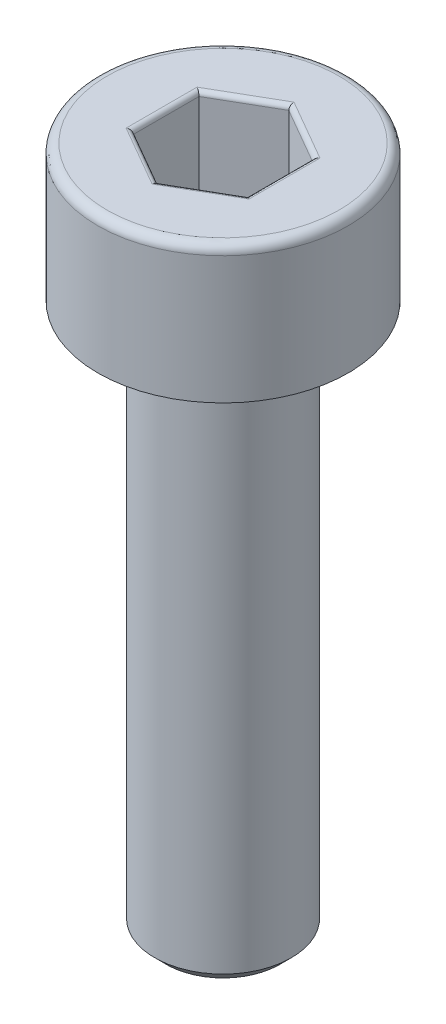
ISO-10303-21;
HEADER;
FILE_DESCRIPTION(('STEP AP214'),'2;1');
FILE_NAME('part.step','',(''),(''),'','','');
FILE_SCHEMA(('AUTOMOTIVE_DESIGN { 1 0 10303 214 1 1 1 1 }'));
ENDSEC;
DATA;
#1=APPLICATION_CONTEXT('core data for automotive mechanical design processes');
#2=APPLICATION_PROTOCOL_DEFINITION('international standard','automotive_design',2000,#1);
#3=PRODUCT_CONTEXT('',#1,'mechanical');
#4=PRODUCT('Part','Part','',(#3));
#5=PRODUCT_RELATED_PRODUCT_CATEGORY('part','',(#4));
#6=PRODUCT_DEFINITION_FORMATION('','',#4);
#7=PRODUCT_DEFINITION_CONTEXT('part definition',#1,'design');
#8=PRODUCT_DEFINITION('design','',#6,#7);
#9=PRODUCT_DEFINITION_SHAPE('','',#8);
#10=(LENGTH_UNIT() NAMED_UNIT(*) SI_UNIT(.MILLI.,.METRE.));
#11=(NAMED_UNIT(*) PLANE_ANGLE_UNIT() SI_UNIT($,.RADIAN.));
#12=(NAMED_UNIT(*) SI_UNIT($,.STERADIAN.) SOLID_ANGLE_UNIT());
#13=UNCERTAINTY_MEASURE_WITH_UNIT(LENGTH_MEASURE(1.E-05),#10,'distance_accuracy_value','');
#14=(GEOMETRIC_REPRESENTATION_CONTEXT(3) GLOBAL_UNCERTAINTY_ASSIGNED_CONTEXT((#13)) GLOBAL_UNIT_ASSIGNED_CONTEXT((#10,
#11,#12)) REPRESENTATION_CONTEXT('',''));
#15=CARTESIAN_POINT('',(0.,0.,0.));
#16=DIRECTION('',(0.,0.,1.));
#17=DIRECTION('',(1.,0.,0.));
#18=AXIS2_PLACEMENT_3D('',#15,#16,#17);
#19=CARTESIAN_POINT('',(0.,-15.,0.));
#20=DIRECTION('',(0.,-1.,0.));
#21=DIRECTION('',(0.,0.,-1.));
#22=AXIS2_PLACEMENT_3D('',#19,#20,#21);
#23=PLANE('',#22);
#24=CARTESIAN_POINT('',(0.,-15.,0.));
#25=DIRECTION('',(0.,-1.,0.));
#26=DIRECTION('',(0.,0.,-1.));
#27=AXIS2_PLACEMENT_3D('',#24,#25,#26);
#28=CIRCLE('',#27,1.25);
#29=CARTESIAN_POINT('',(0.,-15.,-1.25));
#30=VERTEX_POINT('',#29);
#31=EDGE_CURVE('E263',#30,#30,#28,.T.);
#32=ORIENTED_EDGE('',*,*,#31,.T.);
#33=EDGE_LOOP('',(#32));
#34=FACE_BOUND('',#33,.T.);
#35=ADVANCED_FACE('F35',(#34),#23,.T.);
#36=CARTESIAN_POINT('',(0.,0.,0.));
#37=DIRECTION('',(0.,1.,0.));
#38=DIRECTION('',(0.,0.,1.));
#39=AXIS2_PLACEMENT_3D('',#36,#37,#38);
#40=CYLINDRICAL_SURFACE('',#39,1.5);
#41=CARTESIAN_POINT('',(0.,-3.25,0.));
#42=DIRECTION('',(0.,-1.,0.));
#43=DIRECTION('',(0.,0.,-1.));
#44=AXIS2_PLACEMENT_3D('',#41,#42,#43);
#45=CIRCLE('',#44,1.5);
#46=CARTESIAN_POINT('',(0.,-3.25,-1.5));
#47=VERTEX_POINT('',#46);
#48=EDGE_CURVE('E260',#47,#47,#45,.T.);
#49=ORIENTED_EDGE('',*,*,#48,.T.);
#50=EDGE_LOOP('',(#49));
#51=FACE_BOUND('',#50,.T.);
#52=CARTESIAN_POINT('',(0.,-14.75,0.));
#53=DIRECTION('',(0.,-1.,0.));
#54=DIRECTION('',(0.,0.,-1.));
#55=AXIS2_PLACEMENT_3D('',#52,#53,#54);
#56=CIRCLE('',#55,1.5);
#57=CARTESIAN_POINT('',(0.,-14.75,-1.5));
#58=VERTEX_POINT('',#57);
#59=EDGE_CURVE('E257',#58,#58,#56,.F.);
#60=ORIENTED_EDGE('',*,*,#59,.T.);
#61=EDGE_LOOP('',(#60));
#62=FACE_BOUND('',#61,.T.);
#63=ADVANCED_FACE('F289',(#51,#62),#40,.T.);
#64=CARTESIAN_POINT('',(-1.5,-3.,0.));
#65=DIRECTION('',(0.,-1.,0.));
#66=DIRECTION('',(0.,0.,-1.));
#67=AXIS2_PLACEMENT_3D('',#64,#65,#66);
#68=PLANE('',#67);
#69=CARTESIAN_POINT('',(0.,-3.,0.));
#70=DIRECTION('',(0.,-1.,0.));
#71=DIRECTION('',(0.,0.,-1.));
#72=AXIS2_PLACEMENT_3D('',#69,#70,#71);
#73=CIRCLE('',#72,1.75);
#74=CARTESIAN_POINT('',(0.,-3.,-1.75));
#75=VERTEX_POINT('',#74);
#76=EDGE_CURVE('E254',#75,#75,#73,.F.);
#77=ORIENTED_EDGE('',*,*,#76,.T.);
#78=EDGE_LOOP('',(#77));
#79=FACE_BOUND('',#78,.T.);
#80=CARTESIAN_POINT('',(0.,-3.,0.));
#81=DIRECTION('',(0.,1.,0.));
#82=DIRECTION('',(0.,0.,1.));
#83=AXIS2_PLACEMENT_3D('',#80,#81,#82);
#84=CIRCLE('',#83,2.75);
#85=CARTESIAN_POINT('',(0.,-3.,2.75));
#86=VERTEX_POINT('',#85);
#87=EDGE_CURVE('E251',#86,#86,#84,.T.);
#88=ORIENTED_EDGE('',*,*,#87,.F.);
#89=EDGE_LOOP('',(#88));
#90=FACE_BOUND('',#89,.T.);
#91=ADVANCED_FACE('F295',(#79,#90),#68,.T.);
#92=CARTESIAN_POINT('',(0.,0.,0.));
#93=DIRECTION('',(0.,1.,0.));
#94=DIRECTION('',(0.,0.,1.));
#95=AXIS2_PLACEMENT_3D('',#92,#93,#94);
#96=CYLINDRICAL_SURFACE('',#95,2.75);
#97=CARTESIAN_POINT('',(0.,-0.2,0.));
#98=DIRECTION('',(0.,1.,0.));
#99=DIRECTION('',(0.,0.,1.));
#100=AXIS2_PLACEMENT_3D('',#97,#98,#99);
#101=CIRCLE('',#100,2.75);
#102=CARTESIAN_POINT('',(0.,-0.2,2.75));
#103=VERTEX_POINT('',#102);
#104=EDGE_CURVE('E161',#103,#103,#101,.F.);
#105=ORIENTED_EDGE('',*,*,#104,.T.);
#106=EDGE_LOOP('',(#105));
#107=FACE_BOUND('',#106,.T.);
#108=ORIENTED_EDGE('',*,*,#87,.T.);
#109=EDGE_LOOP('',(#108));
#110=FACE_BOUND('',#109,.T.);
#111=ADVANCED_FACE('F305',(#107,#110),#96,.T.);
#112=CARTESIAN_POINT('',(-2.75,0.,0.));
#113=DIRECTION('',(0.,1.,0.));
#114=DIRECTION('',(0.,0.,1.));
#115=AXIS2_PLACEMENT_3D('',#112,#113,#114);
#116=PLANE('',#115);
#117=DIRECTION('',(0.,0.,1.));
#118=VECTOR('',#117,1.);
#119=CARTESIAN_POINT('',(-1.35,0.,-0.721687836487033));
#120=LINE('',#119,#118);
#121=CARTESIAN_POINT('',(-1.35,0.,0.779422863405995));
#122=VERTEX_POINT('',#121);
#123=CARTESIAN_POINT('',(-1.35,0.,-0.779422863405995));
#124=VERTEX_POINT('',#123);
#125=EDGE_CURVE('E177',#122,#124,#120,.F.);
#126=ORIENTED_EDGE('',*,*,#125,.T.);
#127=DIRECTION('',(-0.866025403784439,0.,0.5));
#128=VECTOR('',#127,1.);
#129=CARTESIAN_POINT('',(-0.0500000000000002,0.,-1.52997821335251));
#130=LINE('',#129,#128);
#131=CARTESIAN_POINT('',(0.,0.,-1.55884572681199));
#132=VERTEX_POINT('',#131);
#133=EDGE_CURVE('E136',#124,#132,#130,.F.);
#134=ORIENTED_EDGE('',*,*,#133,.T.);
#135=DIRECTION('',(-0.866025403784439,0.,-0.5));
#136=VECTOR('',#135,1.);
#137=CARTESIAN_POINT('',(1.3,0.,-0.808290376865477));
#138=LINE('',#137,#136);
#139=CARTESIAN_POINT('',(1.35,0.,-0.779422863405995));
#140=VERTEX_POINT('',#139);
#141=EDGE_CURVE('E163',#132,#140,#138,.F.);
#142=ORIENTED_EDGE('',*,*,#141,.T.);
#143=DIRECTION('',(0.,0.,-1.));
#144=VECTOR('',#143,1.);
#145=CARTESIAN_POINT('',(1.35,0.,0.721687836487034));
#146=LINE('',#145,#144);
#147=CARTESIAN_POINT('',(1.35,0.,0.779422863405996));
#148=VERTEX_POINT('',#147);
#149=EDGE_CURVE('E171',#140,#148,#146,.F.);
#150=ORIENTED_EDGE('',*,*,#149,.T.);
#151=DIRECTION('',(0.866025403784439,0.,-0.5));
#152=VECTOR('',#151,1.);
#153=CARTESIAN_POINT('',(0.05,0.,1.52997821335251));
#154=LINE('',#153,#152);
#155=CARTESIAN_POINT('',(0.,0.,1.55884572681199));
#156=VERTEX_POINT('',#155);
#157=EDGE_CURVE('E173',#148,#156,#154,.F.);
#158=ORIENTED_EDGE('',*,*,#157,.T.);
#159=DIRECTION('',(0.866025403784438,0.,0.5));
#160=VECTOR('',#159,1.);
#161=CARTESIAN_POINT('',(-1.3,0.,0.808290376865476));
#162=LINE('',#161,#160);
#163=EDGE_CURVE('E175',#156,#122,#162,.F.);
#164=ORIENTED_EDGE('',*,*,#163,.T.);
#165=EDGE_LOOP('',(#126,#134,#142,#150,#158,#164));
#166=FACE_BOUND('',#165,.T.);
#167=CARTESIAN_POINT('',(0.,0.,0.));
#168=DIRECTION('',(0.,1.,0.));
#169=DIRECTION('',(0.,0.,1.));
#170=AXIS2_PLACEMENT_3D('',#167,#168,#169);
#171=CIRCLE('',#170,2.55);
#172=CARTESIAN_POINT('',(0.,0.,2.55));
#173=VERTEX_POINT('',#172);
#174=EDGE_CURVE('E166',#173,#173,#171,.T.);
#175=ORIENTED_EDGE('',*,*,#174,.T.);
#176=EDGE_LOOP('',(#175));
#177=FACE_BOUND('',#176,.T.);
#178=ADVANCED_FACE('F268',(#166,#177),#116,.T.);
#179=CARTESIAN_POINT('',(0.,-3.,0.));
#180=DIRECTION('',(0.,1.,0.));
#181=DIRECTION('',(0.,0.,1.));
#182=AXIS2_PLACEMENT_3D('',#179,#180,#181);
#183=CONICAL_SURFACE('',#182,1.75,0.785398163397455);
#184=ORIENTED_EDGE('',*,*,#48,.F.);
#185=EDGE_LOOP('',(#184));
#186=FACE_BOUND('',#185,.T.);
#187=ORIENTED_EDGE('',*,*,#76,.F.);
#188=EDGE_LOOP('',(#187));
#189=FACE_BOUND('',#188,.T.);
#190=ADVANCED_FACE('F283',(#186,#189),#183,.T.);
#191=CARTESIAN_POINT('',(0.,-14.75,0.));
#192=DIRECTION('',(0.,1.,0.));
#193=DIRECTION('',(0.,0.,1.));
#194=AXIS2_PLACEMENT_3D('',#191,#192,#193);
#195=CONICAL_SURFACE('',#194,1.5,0.785398163397447);
#196=ORIENTED_EDGE('',*,*,#31,.F.);
#197=EDGE_LOOP('',(#196));
#198=FACE_BOUND('',#197,.T.);
#199=ORIENTED_EDGE('',*,*,#59,.F.);
#200=EDGE_LOOP('',(#199));
#201=FACE_BOUND('',#200,.T.);
#202=ADVANCED_FACE('F273',(#198,#201),#195,.T.);
#203=CARTESIAN_POINT('',(0.,-0.2,0.));
#204=DIRECTION('',(0.,1.,0.));
#205=DIRECTION('',(0.,0.,1.));
#206=AXIS2_PLACEMENT_3D('',#203,#204,#205);
#207=TOROIDAL_SURFACE('',#206,2.55,0.2);
#208=ORIENTED_EDGE('',*,*,#104,.F.);
#209=EDGE_LOOP('',(#208));
#210=FACE_BOUND('',#209,.T.);
#211=ORIENTED_EDGE('',*,*,#174,.F.);
#212=EDGE_LOOP('',(#211));
#213=FACE_BOUND('',#212,.T.);
#214=ADVANCED_FACE('F270',(#210,#213),#207,.T.);
#215=CARTESIAN_POINT('',(1.25,-2.,-0.721687836487033));
#216=DIRECTION('',(0.5,0.,-0.866025403784439));
#217=DIRECTION('',(-0.866025403784439,0.,-0.5));
#218=AXIS2_PLACEMENT_3D('',#215,#216,#217);
#219=PLANE('',#218);
#220=DIRECTION('',(0.,1.,0.));
#221=VECTOR('',#220,1.);
#222=CARTESIAN_POINT('',(1.25,-2.,-0.721687836487033));
#223=LINE('',#222,#221);
#224=CARTESIAN_POINT('',(1.25,-1.9,-0.721687836487033));
#225=VERTEX_POINT('',#224);
#226=CARTESIAN_POINT('',(1.25,-0.1,-0.721687836487033));
#227=VERTEX_POINT('',#226);
#228=EDGE_CURVE('E245',#225,#227,#223,.T.);
#229=ORIENTED_EDGE('',*,*,#228,.T.);
#230=DIRECTION('',(-0.866025403784439,0.,-0.5));
#231=VECTOR('',#230,1.);
#232=CARTESIAN_POINT('',(0.,-0.1,-1.44337567297406));
#233=LINE('',#232,#231);
#234=CARTESIAN_POINT('',(0.,-0.1,-1.44337567297406));
#235=VERTEX_POINT('',#234);
#236=EDGE_CURVE('E197',#227,#235,#233,.T.);
#237=ORIENTED_EDGE('',*,*,#236,.T.);
#238=DIRECTION('',(0.,1.,0.));
#239=VECTOR('',#238,1.);
#240=CARTESIAN_POINT('',(0.,-2.,-1.44337567297406));
#241=LINE('',#240,#239);
#242=CARTESIAN_POINT('',(0.,-1.9,-1.44337567297406));
#243=VERTEX_POINT('',#242);
#244=EDGE_CURVE('E147',#243,#235,#241,.T.);
#245=ORIENTED_EDGE('',*,*,#244,.F.);
#246=DIRECTION('',(-0.866025403784439,0.,-0.5));
#247=VECTOR('',#246,1.);
#248=CARTESIAN_POINT('',(1.25,-1.9,-0.721687836487033));
#249=LINE('',#248,#247);
#250=EDGE_CURVE('E195',#243,#225,#249,.F.);
#251=ORIENTED_EDGE('',*,*,#250,.T.);
#252=EDGE_LOOP('',(#229,#237,#245,#251));
#253=FACE_BOUND('',#252,.T.);
#254=ADVANCED_FACE('F272',(#253),#219,.F.);
#255=CARTESIAN_POINT('',(1.25,-2.,0.721687836487034));
#256=DIRECTION('',(1.,0.,0.));
#257=DIRECTION('',(0.,0.,-1.));
#258=AXIS2_PLACEMENT_3D('',#255,#256,#257);
#259=PLANE('',#258);
#260=DIRECTION('',(0.,1.,0.));
#261=VECTOR('',#260,1.);
#262=CARTESIAN_POINT('',(1.25,-2.,0.721687836487034));
#263=LINE('',#262,#261);
#264=CARTESIAN_POINT('',(1.25,-1.9,0.721687836487034));
#265=VERTEX_POINT('',#264);
#266=CARTESIAN_POINT('',(1.25,-0.1,0.721687836487034));
#267=VERTEX_POINT('',#266);
#268=EDGE_CURVE('E242',#265,#267,#263,.T.);
#269=ORIENTED_EDGE('',*,*,#268,.T.);
#270=DIRECTION('',(0.,0.,-1.));
#271=VECTOR('',#270,1.);
#272=CARTESIAN_POINT('',(1.25,-0.1,-0.721687836487033));
#273=LINE('',#272,#271);
#274=EDGE_CURVE('E193',#267,#227,#273,.T.);
#275=ORIENTED_EDGE('',*,*,#274,.T.);
#276=ORIENTED_EDGE('',*,*,#228,.F.);
#277=DIRECTION('',(0.,0.,-1.));
#278=VECTOR('',#277,1.);
#279=CARTESIAN_POINT('',(1.25,-1.9,0.721687836487034));
#280=LINE('',#279,#278);
#281=EDGE_CURVE('E190',#225,#265,#280,.F.);
#282=ORIENTED_EDGE('',*,*,#281,.T.);
#283=EDGE_LOOP('',(#269,#275,#276,#282));
#284=FACE_BOUND('',#283,.T.);
#285=ADVANCED_FACE('F280',(#284),#259,.F.);
#286=CARTESIAN_POINT('',(0.,-2.,1.44337567297407));
#287=DIRECTION('',(0.5,0.,0.866025403784439));
#288=DIRECTION('',(0.866025403784439,0.,-0.5));
#289=AXIS2_PLACEMENT_3D('',#286,#287,#288);
#290=PLANE('',#289);
#291=DIRECTION('',(0.,1.,0.));
#292=VECTOR('',#291,1.);
#293=CARTESIAN_POINT('',(0.,-2.,1.44337567297407));
#294=LINE('',#293,#292);
#295=CARTESIAN_POINT('',(0.,-1.9,1.44337567297407));
#296=VERTEX_POINT('',#295);
#297=CARTESIAN_POINT('',(0.,-0.1,1.44337567297407));
#298=VERTEX_POINT('',#297);
#299=EDGE_CURVE('E239',#296,#298,#294,.T.);
#300=ORIENTED_EDGE('',*,*,#299,.T.);
#301=DIRECTION('',(0.866025403784439,0.,-0.5));
#302=VECTOR('',#301,1.);
#303=CARTESIAN_POINT('',(1.25,-0.1,0.721687836487034));
#304=LINE('',#303,#302);
#305=EDGE_CURVE('E188',#298,#267,#304,.T.);
#306=ORIENTED_EDGE('',*,*,#305,.T.);
#307=ORIENTED_EDGE('',*,*,#268,.F.);
#308=DIRECTION('',(0.866025403784439,0.,-0.5));
#309=VECTOR('',#308,1.);
#310=CARTESIAN_POINT('',(0.,-1.9,1.44337567297407));
#311=LINE('',#310,#309);
#312=EDGE_CURVE('E186',#265,#296,#311,.F.);
#313=ORIENTED_EDGE('',*,*,#312,.T.);
#314=EDGE_LOOP('',(#300,#306,#307,#313));
#315=FACE_BOUND('',#314,.T.);
#316=ADVANCED_FACE('F329',(#315),#290,.F.);
#317=CARTESIAN_POINT('',(-1.25,-2.,0.721687836487033));
#318=DIRECTION('',(-0.5,0.,0.866025403784439));
#319=DIRECTION('',(0.866025403784438,0.,0.5));
#320=AXIS2_PLACEMENT_3D('',#317,#318,#319);
#321=PLANE('',#320);
#322=DIRECTION('',(0.,1.,0.));
#323=VECTOR('',#322,1.);
#324=CARTESIAN_POINT('',(-1.25,-2.,0.721687836487033));
#325=LINE('',#324,#323);
#326=CARTESIAN_POINT('',(-1.25,-1.9,0.721687836487033));
#327=VERTEX_POINT('',#326);
#328=CARTESIAN_POINT('',(-1.25,-0.1,0.721687836487033));
#329=VERTEX_POINT('',#328);
#330=EDGE_CURVE('E130',#327,#329,#325,.T.);
#331=ORIENTED_EDGE('',*,*,#330,.T.);
#332=DIRECTION('',(0.866025403784438,0.,0.5));
#333=VECTOR('',#332,1.);
#334=CARTESIAN_POINT('',(0.,-0.1,1.44337567297407));
#335=LINE('',#334,#333);
#336=EDGE_CURVE('E184',#329,#298,#335,.T.);
#337=ORIENTED_EDGE('',*,*,#336,.T.);
#338=ORIENTED_EDGE('',*,*,#299,.F.);
#339=DIRECTION('',(0.866025403784438,0.,0.5));
#340=VECTOR('',#339,1.);
#341=CARTESIAN_POINT('',(-1.25,-1.9,0.721687836487033));
#342=LINE('',#341,#340);
#343=EDGE_CURVE('E182',#296,#327,#342,.F.);
#344=ORIENTED_EDGE('',*,*,#343,.T.);
#345=EDGE_LOOP('',(#331,#337,#338,#344));
#346=FACE_BOUND('',#345,.T.);
#347=ADVANCED_FACE('F236',(#346),#321,.F.);
#348=CARTESIAN_POINT('',(-1.25,-2.,-0.721687836487033));
#349=DIRECTION('',(-1.,0.,0.));
#350=DIRECTION('',(0.,0.,1.));
#351=AXIS2_PLACEMENT_3D('',#348,#349,#350);
#352=PLANE('',#351);
#353=DIRECTION('',(0.,1.,0.));
#354=VECTOR('',#353,1.);
#355=CARTESIAN_POINT('',(-1.25,-2.,-0.721687836487033));
#356=LINE('',#355,#354);
#357=CARTESIAN_POINT('',(-1.25,-1.9,-0.721687836487033));
#358=VERTEX_POINT('',#357);
#359=CARTESIAN_POINT('',(-1.25,-0.1,-0.721687836487033));
#360=VERTEX_POINT('',#359);
#361=EDGE_CURVE('E128',#358,#360,#356,.T.);
#362=ORIENTED_EDGE('',*,*,#361,.T.);
#363=DIRECTION('',(0.,0.,1.));
#364=VECTOR('',#363,1.);
#365=CARTESIAN_POINT('',(-1.25,-0.1,0.721687836487033));
#366=LINE('',#365,#364);
#367=EDGE_CURVE('E135',#360,#329,#366,.T.);
#368=ORIENTED_EDGE('',*,*,#367,.T.);
#369=ORIENTED_EDGE('',*,*,#330,.F.);
#370=DIRECTION('',(0.,0.,1.));
#371=VECTOR('',#370,1.);
#372=CARTESIAN_POINT('',(-1.25,-1.9,-0.721687836487033));
#373=LINE('',#372,#371);
#374=EDGE_CURVE('E125',#327,#358,#373,.F.);
#375=ORIENTED_EDGE('',*,*,#374,.T.);
#376=EDGE_LOOP('',(#362,#368,#369,#375));
#377=FACE_BOUND('',#376,.T.);
#378=ADVANCED_FACE('F127',(#377),#352,.F.);
#379=CARTESIAN_POINT('',(0.,-2.,-1.44337567297406));
#380=DIRECTION('',(-0.5,0.,-0.866025403784439));
#381=DIRECTION('',(-0.866025403784439,0.,0.5));
#382=AXIS2_PLACEMENT_3D('',#379,#380,#381);
#383=PLANE('',#382);
#384=ORIENTED_EDGE('',*,*,#244,.T.);
#385=DIRECTION('',(-0.866025403784439,0.,0.5));
#386=VECTOR('',#385,1.);
#387=CARTESIAN_POINT('',(-1.25,-0.1,-0.721687836487032));
#388=LINE('',#387,#386);
#389=EDGE_CURVE('E146',#235,#360,#388,.T.);
#390=ORIENTED_EDGE('',*,*,#389,.T.);
#391=ORIENTED_EDGE('',*,*,#361,.F.);
#392=DIRECTION('',(-0.866025403784439,0.,0.5));
#393=VECTOR('',#392,1.);
#394=CARTESIAN_POINT('',(0.,-1.9,-1.44337567297406));
#395=LINE('',#394,#393);
#396=EDGE_CURVE('E143',#358,#243,#395,.F.);
#397=ORIENTED_EDGE('',*,*,#396,.T.);
#398=EDGE_LOOP('',(#384,#390,#391,#397));
#399=FACE_BOUND('',#398,.T.);
#400=ADVANCED_FACE('F141',(#399),#383,.F.);
#401=CARTESIAN_POINT('',(1.25,-2.,-0.721687836487033));
#402=DIRECTION('',(0.,-1.,0.));
#403=DIRECTION('',(0.,0.,-1.));
#404=AXIS2_PLACEMENT_3D('',#401,#402,#403);
#405=PLANE('',#404);
#406=DIRECTION('',(0.866025403784439,0.,-0.5));
#407=VECTOR('',#406,1.);
#408=CARTESIAN_POINT('',(1.2,-2.,0.63508529610859));
#409=LINE('',#408,#407);
#410=CARTESIAN_POINT('',(0.,-2.,1.32790561913614));
#411=VERTEX_POINT('',#410);
#412=CARTESIAN_POINT('',(1.15,-2.,0.663952809568071));
#413=VERTEX_POINT('',#412);
#414=EDGE_CURVE('E44',#411,#413,#409,.T.);
#415=ORIENTED_EDGE('',*,*,#414,.T.);
#416=DIRECTION('',(0.,0.,-1.));
#417=VECTOR('',#416,1.);
#418=CARTESIAN_POINT('',(1.15,-2.,-0.721687836487033));
#419=LINE('',#418,#417);
#420=CARTESIAN_POINT('',(1.15,-2.,-0.66395280956807));
#421=VERTEX_POINT('',#420);
#422=EDGE_CURVE('E11',#413,#421,#419,.T.);
#423=ORIENTED_EDGE('',*,*,#422,.T.);
#424=DIRECTION('',(-0.866025403784439,0.,-0.5));
#425=VECTOR('',#424,1.);
#426=CARTESIAN_POINT('',(-0.0500000000000001,-2.,-1.35677313259562));
#427=LINE('',#426,#425);
#428=CARTESIAN_POINT('',(0.,-2.,-1.32790561913614));
#429=VERTEX_POINT('',#428);
#430=EDGE_CURVE('E199',#421,#429,#427,.T.);
#431=ORIENTED_EDGE('',*,*,#430,.T.);
#432=DIRECTION('',(-0.866025403784439,0.,0.5));
#433=VECTOR('',#432,1.);
#434=CARTESIAN_POINT('',(-1.2,-2.,-0.635085296108588));
#435=LINE('',#434,#433);
#436=CARTESIAN_POINT('',(-1.15,-2.,-0.66395280956807));
#437=VERTEX_POINT('',#436);
#438=EDGE_CURVE('E201',#429,#437,#435,.T.);
#439=ORIENTED_EDGE('',*,*,#438,.T.);
#440=DIRECTION('',(0.,0.,1.));
#441=VECTOR('',#440,1.);
#442=CARTESIAN_POINT('',(-1.15,-2.,0.721687836487033));
#443=LINE('',#442,#441);
#444=CARTESIAN_POINT('',(-1.15,-2.,0.66395280956807));
#445=VERTEX_POINT('',#444);
#446=EDGE_CURVE('E152',#437,#445,#443,.T.);
#447=ORIENTED_EDGE('',*,*,#446,.T.);
#448=DIRECTION('',(0.866025403784438,0.,0.5));
#449=VECTOR('',#448,1.);
#450=CARTESIAN_POINT('',(0.0499999999999999,-2.,1.35677313259562));
#451=LINE('',#450,#449);
#452=EDGE_CURVE('E55',#445,#411,#451,.T.);
#453=ORIENTED_EDGE('',*,*,#452,.T.);
#454=EDGE_LOOP('',(#415,#423,#431,#439,#447,#453));
#455=FACE_BOUND('',#454,.T.);
#456=ADVANCED_FACE('F324',(#455),#405,.F.);
#457=CARTESIAN_POINT('',(0.05,-0.1,1.52997821335251));
#458=DIRECTION('',(-0.866025403784439,0.,0.5));
#459=DIRECTION('',(0.5,0.,0.866025403784439));
#460=AXIS2_PLACEMENT_3D('',#457,#458,#459);
#461=CYLINDRICAL_SURFACE('',#460,0.1);
#462=CARTESIAN_POINT('',(0.,-0.1,1.55884572681199));
#463=DIRECTION('',(-1.,0.,0.));
#464=DIRECTION('',(0.,0.,-1.));
#465=AXIS2_PLACEMENT_3D('',#462,#463,#464);
#466=ELLIPSE('',#465,0.115470053837925,0.1);
#467=EDGE_CURVE('E216',#156,#298,#466,.T.);
#468=ORIENTED_EDGE('',*,*,#467,.F.);
#469=ORIENTED_EDGE('',*,*,#157,.F.);
#470=CARTESIAN_POINT('',(1.35,-0.1,0.779422863405997));
#471=DIRECTION('',(-0.5,0.,0.866025403784438));
#472=DIRECTION('',(-0.866025403784438,0.,-0.5));
#473=AXIS2_PLACEMENT_3D('',#470,#471,#472);
#474=ELLIPSE('',#473,0.115470053837925,0.1);
#475=EDGE_CURVE('E219',#267,#148,#474,.F.);
#476=ORIENTED_EDGE('',*,*,#475,.F.);
#477=ORIENTED_EDGE('',*,*,#305,.F.);
#478=EDGE_LOOP('',(#468,#469,#476,#477));
#479=FACE_BOUND('',#478,.T.);
#480=ADVANCED_FACE('F336',(#479),#461,.T.);
#481=CARTESIAN_POINT('',(1.35,-0.1,0.721687836487034));
#482=DIRECTION('',(0.,0.,1.));
#483=DIRECTION('',(1.,0.,0.));
#484=AXIS2_PLACEMENT_3D('',#481,#482,#483);
#485=CYLINDRICAL_SURFACE('',#484,0.1);
#486=ORIENTED_EDGE('',*,*,#475,.T.);
#487=ORIENTED_EDGE('',*,*,#149,.F.);
#488=CARTESIAN_POINT('',(1.35,-0.1,-0.779422863405995));
#489=DIRECTION('',(0.5,0.,0.866025403784439));
#490=DIRECTION('',(-0.866025403784439,0.,0.5));
#491=AXIS2_PLACEMENT_3D('',#488,#489,#490);
#492=ELLIPSE('',#491,0.115470053837925,0.1);
#493=EDGE_CURVE('E213',#227,#140,#492,.F.);
#494=ORIENTED_EDGE('',*,*,#493,.F.);
#495=ORIENTED_EDGE('',*,*,#274,.F.);
#496=EDGE_LOOP('',(#486,#487,#494,#495));
#497=FACE_BOUND('',#496,.T.);
#498=ADVANCED_FACE('F340',(#497),#485,.T.);
#499=CARTESIAN_POINT('',(-1.3,-0.1,0.808290376865476));
#500=DIRECTION('',(-0.866025403784438,0.,-0.5));
#501=DIRECTION('',(-0.5,0.,0.866025403784439));
#502=AXIS2_PLACEMENT_3D('',#499,#500,#501);
#503=CYLINDRICAL_SURFACE('',#502,0.1);
#504=ORIENTED_EDGE('',*,*,#467,.T.);
#505=ORIENTED_EDGE('',*,*,#336,.F.);
#506=CARTESIAN_POINT('',(-1.35,-0.1,0.779422863405995));
#507=DIRECTION('',(-0.5,0.,-0.866025403784439));
#508=DIRECTION('',(0.866025403784439,0.,-0.5));
#509=AXIS2_PLACEMENT_3D('',#506,#507,#508);
#510=ELLIPSE('',#509,0.115470053837925,0.1);
#511=EDGE_CURVE('E210',#122,#329,#510,.T.);
#512=ORIENTED_EDGE('',*,*,#511,.F.);
#513=ORIENTED_EDGE('',*,*,#163,.F.);
#514=EDGE_LOOP('',(#504,#505,#512,#513));
#515=FACE_BOUND('',#514,.T.);
#516=ADVANCED_FACE('F346',(#515),#503,.T.);
#517=CARTESIAN_POINT('',(1.3,-0.1,-0.808290376865477));
#518=DIRECTION('',(0.866025403784439,0.,0.5));
#519=DIRECTION('',(0.5,0.,-0.866025403784439));
#520=AXIS2_PLACEMENT_3D('',#517,#518,#519);
#521=CYLINDRICAL_SURFACE('',#520,0.1);
#522=ORIENTED_EDGE('',*,*,#493,.T.);
#523=ORIENTED_EDGE('',*,*,#141,.F.);
#524=CARTESIAN_POINT('',(0.,-0.1,-1.55884572681199));
#525=DIRECTION('',(1.,0.,0.));
#526=DIRECTION('',(0.,0.,-1.));
#527=AXIS2_PLACEMENT_3D('',#524,#525,#526);
#528=ELLIPSE('',#527,0.115470053837925,0.1);
#529=EDGE_CURVE('E208',#235,#132,#528,.F.);
#530=ORIENTED_EDGE('',*,*,#529,.F.);
#531=ORIENTED_EDGE('',*,*,#236,.F.);
#532=EDGE_LOOP('',(#522,#523,#530,#531));
#533=FACE_BOUND('',#532,.T.);
#534=ADVANCED_FACE('F376',(#533),#521,.T.);
#535=CARTESIAN_POINT('',(-1.35,-0.1,-0.721687836487033));
#536=DIRECTION('',(0.,0.,-1.));
#537=DIRECTION('',(-1.,0.,0.));
#538=AXIS2_PLACEMENT_3D('',#535,#536,#537);
#539=CYLINDRICAL_SURFACE('',#538,0.1);
#540=ORIENTED_EDGE('',*,*,#511,.T.);
#541=ORIENTED_EDGE('',*,*,#367,.F.);
#542=CARTESIAN_POINT('',(-1.35,-0.1,-0.779422863405995));
#543=DIRECTION('',(0.5,0.,-0.866025403784439));
#544=DIRECTION('',(0.866025403784439,0.,0.5));
#545=AXIS2_PLACEMENT_3D('',#542,#543,#544);
#546=ELLIPSE('',#545,0.115470053837925,0.1);
#547=EDGE_CURVE('E206',#124,#360,#546,.T.);
#548=ORIENTED_EDGE('',*,*,#547,.F.);
#549=ORIENTED_EDGE('',*,*,#125,.F.);
#550=EDGE_LOOP('',(#540,#541,#548,#549));
#551=FACE_BOUND('',#550,.T.);
#552=ADVANCED_FACE('F371',(#551),#539,.T.);
#553=CARTESIAN_POINT('',(-0.05,-0.1,-1.52997821335251));
#554=DIRECTION('',(0.866025403784439,0.,-0.5));
#555=DIRECTION('',(-0.5,0.,-0.866025403784439));
#556=AXIS2_PLACEMENT_3D('',#553,#554,#555);
#557=CYLINDRICAL_SURFACE('',#556,0.1);
#558=ORIENTED_EDGE('',*,*,#529,.T.);
#559=ORIENTED_EDGE('',*,*,#133,.F.);
#560=ORIENTED_EDGE('',*,*,#547,.T.);
#561=ORIENTED_EDGE('',*,*,#389,.F.);
#562=EDGE_LOOP('',(#558,#559,#560,#561));
#563=FACE_BOUND('',#562,.T.);
#564=ADVANCED_FACE('F367',(#563),#557,.T.);
#565=CARTESIAN_POINT('',(-1.15,-1.9,-0.721687836487033));
#566=DIRECTION('',(0.,0.,-1.));
#567=DIRECTION('',(-1.,0.,0.));
#568=AXIS2_PLACEMENT_3D('',#565,#566,#567);
#569=CYLINDRICAL_SURFACE('',#568,0.1);
#570=CARTESIAN_POINT('',(-1.15,-1.9,-0.663952809568069));
#571=DIRECTION('',(0.5,0.,-0.866025403784439));
#572=DIRECTION('',(-0.866025403784439,0.,-0.5));
#573=AXIS2_PLACEMENT_3D('',#570,#571,#572);
#574=ELLIPSE('',#573,0.115470053837925,0.1);
#575=EDGE_CURVE('E151',#358,#437,#574,.F.);
#576=ORIENTED_EDGE('',*,*,#575,.F.);
#577=ORIENTED_EDGE('',*,*,#374,.F.);
#578=CARTESIAN_POINT('',(-1.15,-1.9,0.66395280956807));
#579=DIRECTION('',(-0.5,0.,-0.866025403784439));
#580=DIRECTION('',(-0.866025403784439,0.,0.5));
#581=AXIS2_PLACEMENT_3D('',#578,#579,#580);
#582=ELLIPSE('',#581,0.115470053837925,0.1);
#583=EDGE_CURVE('E39',#445,#327,#582,.T.);
#584=ORIENTED_EDGE('',*,*,#583,.F.);
#585=ORIENTED_EDGE('',*,*,#446,.F.);
#586=EDGE_LOOP('',(#576,#577,#584,#585));
#587=FACE_BOUND('',#586,.T.);
#588=ADVANCED_FACE('F37',(#587),#569,.F.);
#589=CARTESIAN_POINT('',(0.0499999999999988,-1.9,1.35677313259562));
#590=DIRECTION('',(-0.866025403784438,0.,-0.5));
#591=DIRECTION('',(-0.5,0.,0.866025403784439));
#592=AXIS2_PLACEMENT_3D('',#589,#590,#591);
#593=CYLINDRICAL_SURFACE('',#592,0.1);
#594=ORIENTED_EDGE('',*,*,#583,.T.);
#595=ORIENTED_EDGE('',*,*,#343,.F.);
#596=CARTESIAN_POINT('',(0.,-1.9,1.32790561913614));
#597=DIRECTION('',(-1.,0.,0.));
#598=DIRECTION('',(0.,0.,1.));
#599=AXIS2_PLACEMENT_3D('',#596,#597,#598);
#600=ELLIPSE('',#599,0.115470053837925,0.1);
#601=EDGE_CURVE('E155',#411,#296,#600,.T.);
#602=ORIENTED_EDGE('',*,*,#601,.F.);
#603=ORIENTED_EDGE('',*,*,#452,.F.);
#604=EDGE_LOOP('',(#594,#595,#602,#603));
#605=FACE_BOUND('',#604,.T.);
#606=ADVANCED_FACE('F233',(#605),#593,.F.);
#607=CARTESIAN_POINT('',(0.675,-1.9,-1.71761705083914));
#608=DIRECTION('',(0.866025403784439,0.,-0.5));
#609=DIRECTION('',(-0.5,0.,-0.866025403784439));
#610=AXIS2_PLACEMENT_3D('',#607,#608,#609);
#611=CYLINDRICAL_SURFACE('',#610,0.1);
#612=ORIENTED_EDGE('',*,*,#575,.T.);
#613=ORIENTED_EDGE('',*,*,#438,.F.);
#614=CARTESIAN_POINT('',(0.,-1.9,-1.32790561913614));
#615=DIRECTION('',(1.,0.,0.));
#616=DIRECTION('',(0.,0.,-1.));
#617=AXIS2_PLACEMENT_3D('',#614,#615,#616);
#618=ELLIPSE('',#617,0.115470053837925,0.1);
#619=EDGE_CURVE('E159',#243,#429,#618,.F.);
#620=ORIENTED_EDGE('',*,*,#619,.F.);
#621=ORIENTED_EDGE('',*,*,#396,.F.);
#622=EDGE_LOOP('',(#612,#613,#620,#621));
#623=FACE_BOUND('',#622,.T.);
#624=ADVANCED_FACE('F157',(#623),#611,.F.);
#625=CARTESIAN_POINT('',(1.825,-1.9,0.274241377865074));
#626=DIRECTION('',(-0.866025403784439,0.,0.5));
#627=DIRECTION('',(0.5,0.,0.866025403784439));
#628=AXIS2_PLACEMENT_3D('',#625,#626,#627);
#629=CYLINDRICAL_SURFACE('',#628,0.1);
#630=ORIENTED_EDGE('',*,*,#601,.T.);
#631=ORIENTED_EDGE('',*,*,#312,.F.);
#632=CARTESIAN_POINT('',(1.15,-1.9,0.663952809568072));
#633=DIRECTION('',(-0.5,0.,0.866025403784438));
#634=DIRECTION('',(0.866025403784438,0.,0.5));
#635=AXIS2_PLACEMENT_3D('',#632,#633,#634);
#636=ELLIPSE('',#635,0.115470053837925,0.1);
#637=EDGE_CURVE('E224',#413,#265,#636,.T.);
#638=ORIENTED_EDGE('',*,*,#637,.F.);
#639=ORIENTED_EDGE('',*,*,#414,.F.);
#640=EDGE_LOOP('',(#630,#631,#638,#639));
#641=FACE_BOUND('',#640,.T.);
#642=ADVANCED_FACE('F230',(#641),#629,.F.);
#643=CARTESIAN_POINT('',(1.2,-1.9,-0.635085296108589));
#644=DIRECTION('',(0.866025403784439,0.,0.5));
#645=DIRECTION('',(0.5,0.,-0.866025403784439));
#646=AXIS2_PLACEMENT_3D('',#643,#644,#645);
#647=CYLINDRICAL_SURFACE('',#646,0.1);
#648=ORIENTED_EDGE('',*,*,#619,.T.);
#649=ORIENTED_EDGE('',*,*,#430,.F.);
#650=CARTESIAN_POINT('',(1.15,-1.9,-0.66395280956807));
#651=DIRECTION('',(0.5,0.,0.866025403784439));
#652=DIRECTION('',(-0.866025403784439,0.,0.5));
#653=AXIS2_PLACEMENT_3D('',#650,#651,#652);
#654=ELLIPSE('',#653,0.115470053837925,0.1);
#655=EDGE_CURVE('E222',#225,#421,#654,.F.);
#656=ORIENTED_EDGE('',*,*,#655,.F.);
#657=ORIENTED_EDGE('',*,*,#250,.F.);
#658=EDGE_LOOP('',(#648,#649,#656,#657));
#659=FACE_BOUND('',#658,.T.);
#660=ADVANCED_FACE('F355',(#659),#647,.F.);
#661=CARTESIAN_POINT('',(1.15,-1.9,-0.721687836487033));
#662=DIRECTION('',(0.,0.,1.));
#663=DIRECTION('',(1.,0.,0.));
#664=AXIS2_PLACEMENT_3D('',#661,#662,#663);
#665=CYLINDRICAL_SURFACE('',#664,0.1);
#666=ORIENTED_EDGE('',*,*,#637,.T.);
#667=ORIENTED_EDGE('',*,*,#281,.F.);
#668=ORIENTED_EDGE('',*,*,#655,.T.);
#669=ORIENTED_EDGE('',*,*,#422,.F.);
#670=EDGE_LOOP('',(#666,#667,#668,#669));
#671=FACE_BOUND('',#670,.T.);
#672=ADVANCED_FACE('F352',(#671),#665,.F.);
#673=CLOSED_SHELL('',(#35,#63,#91,#111,#178,#190,#202,#214,#254,#285,#316,#347,#378,#400,#456,
#480,#498,#516,#534,#552,#564,#588,#606,#624,#642,#660,#672));
#674=MANIFOLD_SOLID_BREP('B2',#673);
#675=ADVANCED_BREP_SHAPE_REPRESENTATION('',(#18,#674),#14);
#676=SHAPE_DEFINITION_REPRESENTATION(#9,#675);
ENDSEC;
END-ISO-10303-21;
